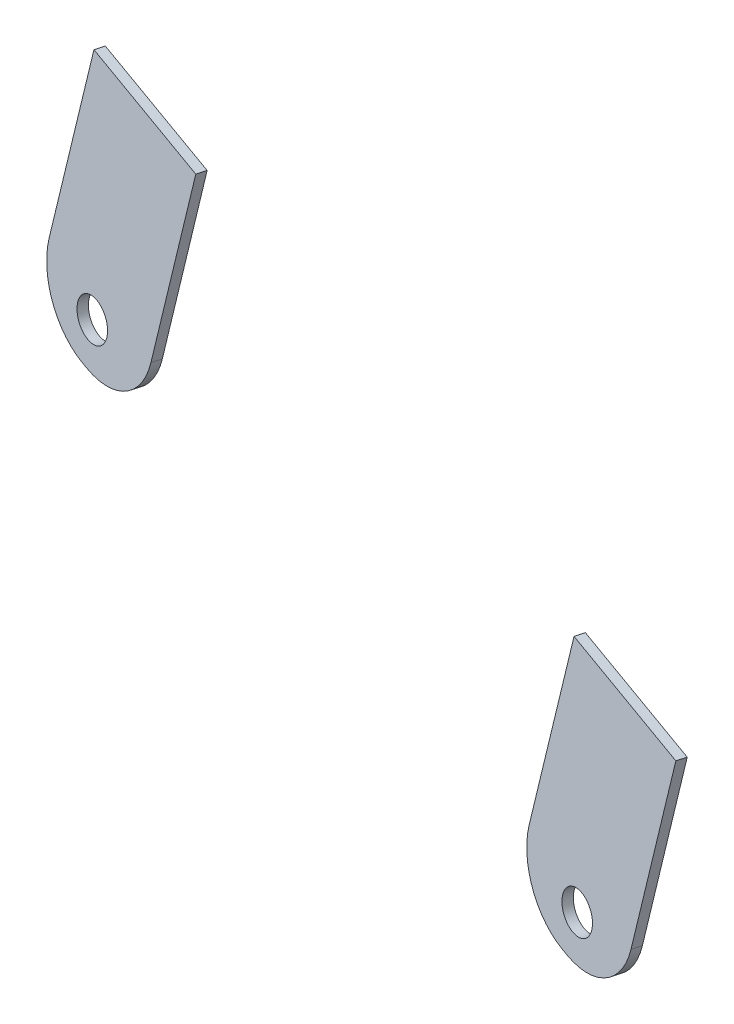
ISO-10303-21;
HEADER;
FILE_DESCRIPTION(('STEP AP214'),'2;1');
FILE_NAME('part.step','',(''),(''),'','','');
FILE_SCHEMA(('AUTOMOTIVE_DESIGN { 1 0 10303 214 1 1 1 1 }'));
ENDSEC;
DATA;
#1=APPLICATION_CONTEXT('core data for automotive mechanical design processes');
#2=APPLICATION_PROTOCOL_DEFINITION('international standard','automotive_design',2000,#1);
#3=PRODUCT_CONTEXT('',#1,'mechanical');
#4=PRODUCT('Part','Part','',(#3));
#5=PRODUCT_RELATED_PRODUCT_CATEGORY('part','',(#4));
#6=PRODUCT_DEFINITION_FORMATION('','',#4);
#7=PRODUCT_DEFINITION_CONTEXT('part definition',#1,'design');
#8=PRODUCT_DEFINITION('design','',#6,#7);
#9=PRODUCT_DEFINITION_SHAPE('','',#8);
#10=(LENGTH_UNIT() NAMED_UNIT(*) SI_UNIT(.MILLI.,.METRE.));
#11=(NAMED_UNIT(*) PLANE_ANGLE_UNIT() SI_UNIT($,.RADIAN.));
#12=(NAMED_UNIT(*) SI_UNIT($,.STERADIAN.) SOLID_ANGLE_UNIT());
#13=UNCERTAINTY_MEASURE_WITH_UNIT(LENGTH_MEASURE(1.E-05),#10,'distance_accuracy_value','');
#14=(GEOMETRIC_REPRESENTATION_CONTEXT(3) GLOBAL_UNCERTAINTY_ASSIGNED_CONTEXT((#13)) GLOBAL_UNIT_ASSIGNED_CONTEXT((#10,
#11,#12)) REPRESENTATION_CONTEXT('',''));
#15=CARTESIAN_POINT('',(0.,0.,0.));
#16=DIRECTION('',(0.,0.,1.));
#17=DIRECTION('',(1.,0.,0.));
#18=AXIS2_PLACEMENT_3D('',#15,#16,#17);
#19=CARTESIAN_POINT('',(21.345341230232,-6.68938215923422,-106.870411545878));
#20=DIRECTION('',(-0.195494617046695,0.0612657436296361,0.978789233371145));
#21=DIRECTION('',(0.98063135925573,0.,0.195862546813473));
#22=AXIS2_PLACEMENT_3D('',#19,#20,#21);
#23=PLANE('',#22);
#24=CARTESIAN_POINT('',(1126.13259403168,-258.790626718577,129.569797675979));
#25=DIRECTION('',(-0.195494617046686,0.061265743629639,0.978789233371147));
#26=DIRECTION('',(0.980631359255732,0.,0.195862546813464));
#27=AXIS2_PLACEMENT_3D('',#24,#25,#26);
#28=CIRCLE('',#27,2.99999999999978);
#29=CARTESIAN_POINT('',(1129.07448810945,-258.790626718577,130.157385316419));
#30=VERTEX_POINT('',#29);
#31=EDGE_CURVE('E133',#30,#30,#28,.T.);
#32=ORIENTED_EDGE('',*,*,#31,.F.);
#33=EDGE_LOOP('',(#32));
#34=FACE_BOUND('',#33,.T.);
#35=DIRECTION('',(0.222947026454173,0.974691253639158,-0.0164797898824405));
#36=VECTOR('',#35,1.);
#37=CARTESIAN_POINT('',(1140.01603064823,-241.996628761115,131.291557881148));
#38=LINE('',#37,#36);
#39=CARTESIAN_POINT('',(1136.44887822496,-257.591688819341,131.555234519267));
#40=VERTEX_POINT('',#39);
#41=CARTESIAN_POINT('',(1142.91434199214,-229.325642463806,131.077320612677));
#42=VERTEX_POINT('',#41);
#43=EDGE_CURVE('E108',#40,#42,#38,.T.);
#44=ORIENTED_EDGE('',*,*,#43,.T.);
#45=DIRECTION('',(0.955026951505036,-0.214996438893382,0.204205908734691));
#46=VECTOR('',#45,1.);
#47=CARTESIAN_POINT('',(1122.85877601053,-224.810717247044,126.788996529248));
#48=LINE('',#47,#46);
#49=CARTESIAN_POINT('',(1122.85877601053,-224.810717247044,126.788996529248));
#50=VERTEX_POINT('',#49);
#51=EDGE_CURVE('E190',#50,#42,#48,.T.);
#52=ORIENTED_EDGE('',*,*,#51,.F.);
#53=DIRECTION('',(-0.222947026454173,-0.974691253639158,0.016479789882437));
#54=VECTOR('',#53,1.);
#55=CARTESIAN_POINT('',(1119.96046466662,-237.481703544353,127.00323379772));
#56=LINE('',#55,#54);
#57=CARTESIAN_POINT('',(1116.39331224336,-253.07676360258,127.266910435839));
#58=VERTEX_POINT('',#57);
#59=EDGE_CURVE('E58',#50,#58,#56,.T.);
#60=ORIENTED_EDGE('',*,*,#59,.T.);
#61=CARTESIAN_POINT('',(1125.94358175841,-255.226727991514,129.308969523186));
#62=DIRECTION('',(-0.195494617046709,0.0612657436296458,0.978789233371142));
#63=DIRECTION('',(0.980631359255727,0.,0.195862546813487));
#64=AXIS2_PLACEMENT_3D('',#61,#62,#63);
#65=CIRCLE('',#64,10.);
#66=CARTESIAN_POINT('',(1123.71411149387,-264.973640527905,129.47376742201));
#67=VERTEX_POINT('',#66);
#68=EDGE_CURVE('E152',#58,#67,#65,.T.);
#69=ORIENTED_EDGE('',*,*,#68,.T.);
#70=DIRECTION('',(0.955026951505051,-0.214996438893341,0.204205908734669));
#71=VECTOR('',#70,1.);
#72=CARTESIAN_POINT('',(1123.71411149387,-264.973640527905,129.47376742201));
#73=LINE('',#72,#71);
#74=CARTESIAN_POINT('',(1124.66913844537,-265.188636966799,129.677973330745));
#75=VERTEX_POINT('',#74);
#76=EDGE_CURVE('E116',#67,#75,#73,.T.);
#77=ORIENTED_EDGE('',*,*,#76,.T.);
#78=CARTESIAN_POINT('',(1126.89860870991,-255.441724430407,129.51317543192));
#79=DIRECTION('',(-0.195494617046711,0.061265743629641,0.978789233371141));
#80=DIRECTION('',(0.980631359255727,0.,0.195862546813489));
#81=AXIS2_PLACEMENT_3D('',#78,#79,#80);
#82=CIRCLE('',#81,9.9999999999999);
#83=EDGE_CURVE('E101',#75,#40,#82,.T.);
#84=ORIENTED_EDGE('',*,*,#83,.T.);
#85=EDGE_LOOP('',(#44,#52,#60,#69,#77,#84));
#86=FACE_BOUND('',#85,.T.);
#87=ADVANCED_FACE('F49',(#34,#86),#23,.T.);
#88=CARTESIAN_POINT('',(21.6385831558019,-6.78128077467864,-108.338595395934));
#89=DIRECTION('',(-0.195494617046695,0.0612657436296361,0.978789233371145));
#90=DIRECTION('',(0.98063135925573,0.,0.195862546813473));
#91=AXIS2_PLACEMENT_3D('',#88,#89,#90);
#92=PLANE('',#91);
#93=CARTESIAN_POINT('',(1126.42583595725,-258.882525334021,128.101613825922));
#94=DIRECTION('',(-0.195494617046686,0.061265743629639,0.978789233371147));
#95=DIRECTION('',(0.980631359255732,0.,0.195862546813464));
#96=AXIS2_PLACEMENT_3D('',#93,#94,#95);
#97=CIRCLE('',#96,2.99999999999978);
#98=CARTESIAN_POINT('',(1129.36773003502,-258.882525334021,128.689201466363));
#99=VERTEX_POINT('',#98);
#100=EDGE_CURVE('E139',#99,#99,#97,.T.);
#101=ORIENTED_EDGE('',*,*,#100,.T.);
#102=EDGE_LOOP('',(#101));
#103=FACE_BOUND('',#102,.T.);
#104=DIRECTION('',(-0.222947026454173,-0.974691253639158,0.016479789882437));
#105=VECTOR('',#104,1.);
#106=CARTESIAN_POINT('',(1120.25370659219,-237.573602159798,125.535049947663));
#107=LINE('',#106,#105);
#108=CARTESIAN_POINT('',(1123.1520179361,-224.902615862489,125.320812679191));
#109=VERTEX_POINT('',#108);
#110=CARTESIAN_POINT('',(1116.68655416893,-253.168662218024,125.798726585782));
#111=VERTEX_POINT('',#110);
#112=EDGE_CURVE('E13',#109,#111,#107,.T.);
#113=ORIENTED_EDGE('',*,*,#112,.F.);
#114=DIRECTION('',(-0.955026951505036,0.214996438893381,-0.204205908734695));
#115=VECTOR('',#114,1.);
#116=CARTESIAN_POINT('',(1143.20758391771,-229.41754107925,129.60913676262));
#117=LINE('',#116,#115);
#118=CARTESIAN_POINT('',(1143.20758391771,-229.41754107925,129.60913676262));
#119=VERTEX_POINT('',#118);
#120=EDGE_CURVE('E97',#119,#109,#117,.T.);
#121=ORIENTED_EDGE('',*,*,#120,.F.);
#122=DIRECTION('',(0.222947026454173,0.974691253639158,-0.0164797898824405));
#123=VECTOR('',#122,1.);
#124=CARTESIAN_POINT('',(1140.3092725738,-242.088527376559,129.823374031092));
#125=LINE('',#124,#123);
#126=CARTESIAN_POINT('',(1136.74212015053,-257.683587434785,130.087050669211));
#127=VERTEX_POINT('',#126);
#128=EDGE_CURVE('E89',#127,#119,#125,.T.);
#129=ORIENTED_EDGE('',*,*,#128,.F.);
#130=CARTESIAN_POINT('',(1127.19185063548,-255.533623045852,128.044991581864));
#131=DIRECTION('',(-0.195494617046711,0.061265743629641,0.978789233371141));
#132=DIRECTION('',(0.980631359255727,0.,0.195862546813489));
#133=AXIS2_PLACEMENT_3D('',#130,#131,#132);
#134=CIRCLE('',#133,9.9999999999999);
#135=CARTESIAN_POINT('',(1124.96238037094,-265.280535582243,128.209789480688));
#136=VERTEX_POINT('',#135);
#137=EDGE_CURVE('E93',#136,#127,#134,.T.);
#138=ORIENTED_EDGE('',*,*,#137,.F.);
#139=DIRECTION('',(0.955026951505051,-0.214996438893341,0.204205908734669));
#140=VECTOR('',#139,1.);
#141=CARTESIAN_POINT('',(1124.00735341944,-265.06553914335,128.005583571953));
#142=LINE('',#141,#140);
#143=CARTESIAN_POINT('',(1124.00735341944,-265.06553914335,128.005583571953));
#144=VERTEX_POINT('',#143);
#145=EDGE_CURVE('E162',#144,#136,#142,.T.);
#146=ORIENTED_EDGE('',*,*,#145,.F.);
#147=CARTESIAN_POINT('',(1126.23682368398,-255.318626606958,127.840785673129));
#148=DIRECTION('',(-0.195494617046709,0.0612657436296458,0.978789233371142));
#149=DIRECTION('',(0.980631359255727,0.,0.195862546813487));
#150=AXIS2_PLACEMENT_3D('',#147,#148,#149);
#151=CIRCLE('',#150,10.);
#152=EDGE_CURVE('E67',#111,#144,#151,.T.);
#153=ORIENTED_EDGE('',*,*,#152,.F.);
#154=EDGE_LOOP('',(#113,#121,#129,#138,#146,#153));
#155=FACE_BOUND('',#154,.T.);
#156=ADVANCED_FACE('F91',(#103,#155),#92,.F.);
#157=CARTESIAN_POINT('',(1140.3092725738,-242.088527376559,129.823374031092));
#158=DIRECTION('',(0.955026951505059,-0.214996438893385,0.204205908734582));
#159=DIRECTION('',(0.219624372916741,0.975584509317839,0.));
#160=AXIS2_PLACEMENT_3D('',#157,#158,#159);
#161=PLANE('',#160);
#162=ORIENTED_EDGE('',*,*,#43,.F.);
#163=DIRECTION('',(-0.195494617046597,0.061265743629616,0.978789233371166));
#164=VECTOR('',#163,1.);
#165=CARTESIAN_POINT('',(1136.74212015053,-257.683587434785,130.087050669211));
#166=LINE('',#165,#164);
#167=EDGE_CURVE('E102',#127,#40,#166,.T.);
#168=ORIENTED_EDGE('',*,*,#167,.F.);
#169=ORIENTED_EDGE('',*,*,#128,.T.);
#170=DIRECTION('',(0.195494617046597,-0.0612657436296344,-0.978789233371165));
#171=VECTOR('',#170,1.);
#172=CARTESIAN_POINT('',(1142.91434199214,-229.325642463806,131.077320612677));
#173=LINE('',#172,#171);
#174=EDGE_CURVE('E189',#42,#119,#173,.T.);
#175=ORIENTED_EDGE('',*,*,#174,.F.);
#176=EDGE_LOOP('',(#162,#168,#169,#175));
#177=FACE_BOUND('',#176,.T.);
#178=ADVANCED_FACE('F106',(#177),#161,.T.);
#179=CARTESIAN_POINT('',(1127.19185063548,-255.533623045852,128.044991581864));
#180=DIRECTION('',(-0.195494617046597,0.061265743629616,0.978789233371166));
#181=DIRECTION('',(0.980631359255749,0.,0.195862546813375));
#182=AXIS2_PLACEMENT_3D('',#179,#180,#181);
#183=CYLINDRICAL_SURFACE('',#182,9.9999999999999);
#184=ORIENTED_EDGE('',*,*,#83,.F.);
#185=DIRECTION('',(-0.195494617046597,0.061265743629616,0.978789233371166));
#186=VECTOR('',#185,1.);
#187=CARTESIAN_POINT('',(1124.96238037094,-265.280535582243,128.209789480688));
#188=LINE('',#187,#186);
#189=EDGE_CURVE('E114',#136,#75,#188,.T.);
#190=ORIENTED_EDGE('',*,*,#189,.F.);
#191=ORIENTED_EDGE('',*,*,#137,.T.);
#192=ORIENTED_EDGE('',*,*,#167,.T.);
#193=EDGE_LOOP('',(#184,#190,#191,#192));
#194=FACE_BOUND('',#193,.T.);
#195=ADVANCED_FACE('F112',(#194),#183,.T.);
#196=CARTESIAN_POINT('',(1124.00735341944,-265.06553914335,128.005583571953));
#197=DIRECTION('',(-0.222947026454135,-0.974691253639166,0.0164797898824463));
#198=DIRECTION('',(0.974823635622994,-0.222977306986088,0.));
#199=AXIS2_PLACEMENT_3D('',#196,#197,#198);
#200=PLANE('',#199);
#201=ORIENTED_EDGE('',*,*,#76,.F.);
#202=DIRECTION('',(-0.195494617046597,0.061265743629616,0.978789233371166));
#203=VECTOR('',#202,1.);
#204=CARTESIAN_POINT('',(1124.00735341944,-265.06553914335,128.005583571953));
#205=LINE('',#204,#203);
#206=EDGE_CURVE('E118',#144,#67,#205,.T.);
#207=ORIENTED_EDGE('',*,*,#206,.F.);
#208=ORIENTED_EDGE('',*,*,#145,.T.);
#209=ORIENTED_EDGE('',*,*,#189,.T.);
#210=EDGE_LOOP('',(#201,#207,#208,#209));
#211=FACE_BOUND('',#210,.T.);
#212=ADVANCED_FACE('F176',(#211),#200,.T.);
#213=CARTESIAN_POINT('',(1126.23682368398,-255.318626606958,127.840785673129));
#214=DIRECTION('',(-0.195494617046597,0.061265743629616,0.978789233371166));
#215=DIRECTION('',(0.980631359255749,0.,0.195862546813375));
#216=AXIS2_PLACEMENT_3D('',#213,#214,#215);
#217=CYLINDRICAL_SURFACE('',#216,10.);
#218=ORIENTED_EDGE('',*,*,#68,.F.);
#219=DIRECTION('',(-0.195494617046597,0.061265743629616,0.978789233371166));
#220=VECTOR('',#219,1.);
#221=CARTESIAN_POINT('',(1116.68655416893,-253.168662218024,125.798726585782));
#222=LINE('',#221,#220);
#223=EDGE_CURVE('E149',#111,#58,#222,.T.);
#224=ORIENTED_EDGE('',*,*,#223,.F.);
#225=ORIENTED_EDGE('',*,*,#152,.T.);
#226=ORIENTED_EDGE('',*,*,#206,.T.);
#227=EDGE_LOOP('',(#218,#224,#225,#226));
#228=FACE_BOUND('',#227,.T.);
#229=ADVANCED_FACE('F179',(#228),#217,.T.);
#230=CARTESIAN_POINT('',(1120.25370659219,-237.573602159798,125.535049947663));
#231=DIRECTION('',(-0.955026951505059,0.214996438893386,-0.204205908734582));
#232=DIRECTION('',(-0.219624372916742,-0.975584509317838,0.));
#233=AXIS2_PLACEMENT_3D('',#230,#231,#232);
#234=PLANE('',#233);
#235=ORIENTED_EDGE('',*,*,#59,.F.);
#236=DIRECTION('',(-0.195494617046736,0.0612657436296684,0.978789233371135));
#237=VECTOR('',#236,1.);
#238=CARTESIAN_POINT('',(1123.1520179361,-224.902615862489,125.320812679191));
#239=LINE('',#238,#237);
#240=EDGE_CURVE('E185',#109,#50,#239,.T.);
#241=ORIENTED_EDGE('',*,*,#240,.F.);
#242=ORIENTED_EDGE('',*,*,#112,.T.);
#243=ORIENTED_EDGE('',*,*,#223,.T.);
#244=EDGE_LOOP('',(#235,#241,#242,#243));
#245=FACE_BOUND('',#244,.T.);
#246=ADVANCED_FACE('F183',(#245),#234,.T.);
#247=CARTESIAN_POINT('',(1126.42583595725,-258.882525334021,128.101613825922));
#248=DIRECTION('',(-0.195494617046597,0.061265743629616,0.978789233371166));
#249=DIRECTION('',(0.980631359255749,0.,0.195862546813375));
#250=AXIS2_PLACEMENT_3D('',#247,#248,#249);
#251=CYLINDRICAL_SURFACE('',#250,2.99999999999978);
#252=ORIENTED_EDGE('',*,*,#100,.F.);
#253=EDGE_LOOP('',(#252));
#254=FACE_BOUND('',#253,.T.);
#255=ORIENTED_EDGE('',*,*,#31,.T.);
#256=EDGE_LOOP('',(#255));
#257=FACE_BOUND('',#256,.T.);
#258=ADVANCED_FACE('F198',(#254,#257),#251,.F.);
#259=CARTESIAN_POINT('',(6.49389606596524,28.3903481387716,-0.480015564179602));
#260=DIRECTION('',(0.22294702645418,0.974691253639156,-0.0164797898824577));
#261=DIRECTION('',(-0.974823635622984,0.222977306986134,0.));
#262=AXIS2_PLACEMENT_3D('',#259,#260,#261);
#263=PLANE('',#262);
#264=ORIENTED_EDGE('',*,*,#240,.T.);
#265=ORIENTED_EDGE('',*,*,#51,.T.);
#266=ORIENTED_EDGE('',*,*,#174,.T.);
#267=ORIENTED_EDGE('',*,*,#120,.T.);
#268=EDGE_LOOP('',(#264,#265,#266,#267));
#269=FACE_BOUND('',#268,.T.);
#270=ADVANCED_FACE('F187',(#269),#263,.T.);
#271=CLOSED_SHELL('',(#87,#156,#178,#195,#212,#229,#246,#258,#270));
#272=MANIFOLD_SOLID_BREP('B2',#271);
#273=CARTESIAN_POINT('',(21.3453412302332,-6.68938215923501,-106.870411545882));
#274=DIRECTION('',(-0.195494617046698,0.0612657436296406,0.978789233371144));
#275=DIRECTION('',(0.980631359255729,0.,0.195862546813475));
#276=AXIS2_PLACEMENT_3D('',#273,#274,#275);
#277=PLANE('',#276);
#278=CARTESIAN_POINT('',(1030.62989888117,-237.290982829239,109.14920680251));
#279=DIRECTION('',(-0.195494617046672,0.0612657436296438,0.978789233371149));
#280=DIRECTION('',(0.980631359255735,0.,0.195862546813449));
#281=AXIS2_PLACEMENT_3D('',#278,#279,#280);
#282=CIRCLE('',#281,3.00000000000002);
#283=CARTESIAN_POINT('',(1033.57179295894,-237.290982829239,109.73679444295));
#284=VERTEX_POINT('',#283);
#285=EDGE_CURVE('E370',#284,#284,#282,.T.);
#286=ORIENTED_EDGE('',*,*,#285,.F.);
#287=EDGE_LOOP('',(#286));
#288=FACE_BOUND('',#287,.T.);
#289=DIRECTION('',(0.222947026454173,0.974691253639158,-0.016479789882444));
#290=VECTOR('',#289,1.);
#291=CARTESIAN_POINT('',(1045.46836244923,-220.71198131067,111.075172916413));
#292=LINE('',#291,#290);
#293=CARTESIAN_POINT('',(1041.90121002596,-236.307041368896,111.338849554532));
#294=VERTEX_POINT('',#293);
#295=CARTESIAN_POINT('',(1048.36667379314,-208.040995013361,110.860935647942));
#296=VERTEX_POINT('',#295);
#297=EDGE_CURVE('E345',#294,#296,#292,.T.);
#298=ORIENTED_EDGE('',*,*,#297,.T.);
#299=DIRECTION('',(0.955026951505036,-0.214996438893383,0.204205908734691));
#300=VECTOR('',#299,1.);
#301=CARTESIAN_POINT('',(1028.31110781153,-203.5260697966,106.572611564513));
#302=LINE('',#301,#300);
#303=CARTESIAN_POINT('',(1028.31110781153,-203.5260697966,106.572611564513));
#304=VERTEX_POINT('',#303);
#305=EDGE_CURVE('E427',#304,#296,#302,.T.);
#306=ORIENTED_EDGE('',*,*,#305,.F.);
#307=DIRECTION('',(-0.222947026454173,-0.974691253639158,0.016479789882437));
#308=VECTOR('',#307,1.);
#309=CARTESIAN_POINT('',(1025.41279646763,-216.197056093909,106.786848832985));
#310=LINE('',#309,#308);
#311=CARTESIAN_POINT('',(1021.84564404436,-231.792116152135,107.050525471104));
#312=VERTEX_POINT('',#311);
#313=EDGE_CURVE('E295',#304,#312,#310,.T.);
#314=ORIENTED_EDGE('',*,*,#313,.T.);
#315=CARTESIAN_POINT('',(1031.39591355941,-233.942080541069,109.092584558451));
#316=DIRECTION('',(-0.195494617046711,0.0612657436296436,0.978789233371141));
#317=DIRECTION('',(0.980631359255727,0.,0.195862546813489));
#318=AXIS2_PLACEMENT_3D('',#315,#316,#317);
#319=CIRCLE('',#318,9.99999999999994);
#320=CARTESIAN_POINT('',(1029.16644329487,-243.68899307746,109.257382457275));
#321=VERTEX_POINT('',#320);
#322=EDGE_CURVE('E389',#312,#321,#319,.T.);
#323=ORIENTED_EDGE('',*,*,#322,.T.);
#324=DIRECTION('',(0.955026951505053,-0.214996438893336,0.204205908734661));
#325=VECTOR('',#324,1.);
#326=CARTESIAN_POINT('',(1029.16644329487,-243.68899307746,109.257382457275));
#327=LINE('',#326,#325);
#328=CARTESIAN_POINT('',(1030.12147024637,-243.903989516354,109.46158836601));
#329=VERTEX_POINT('',#328);
#330=EDGE_CURVE('E353',#321,#329,#327,.T.);
#331=ORIENTED_EDGE('',*,*,#330,.T.);
#332=CARTESIAN_POINT('',(1032.35094051091,-234.157076979962,109.296790467186));
#333=DIRECTION('',(-0.19549461704671,0.0612657436296432,0.978789233371142));
#334=DIRECTION('',(0.980631359255727,0.,0.195862546813487));
#335=AXIS2_PLACEMENT_3D('',#332,#333,#334);
#336=CIRCLE('',#335,10.);
#337=EDGE_CURVE('E338',#329,#294,#336,.T.);
#338=ORIENTED_EDGE('',*,*,#337,.T.);
#339=EDGE_LOOP('',(#298,#306,#314,#323,#331,#338));
#340=FACE_BOUND('',#339,.T.);
#341=ADVANCED_FACE('F286',(#288,#340),#277,.T.);
#342=CARTESIAN_POINT('',(21.6385831558031,-6.78128077467943,-108.338595395939));
#343=DIRECTION('',(-0.195494617046698,0.0612657436296406,0.978789233371144));
#344=DIRECTION('',(0.980631359255729,0.,0.195862546813475));
#345=AXIS2_PLACEMENT_3D('',#342,#343,#344);
#346=PLANE('',#345);
#347=CARTESIAN_POINT('',(1030.92314080674,-237.382881444683,107.681022952453));
#348=DIRECTION('',(-0.195494617046672,0.0612657436296438,0.978789233371149));
#349=DIRECTION('',(0.980631359255735,0.,0.195862546813449));
#350=AXIS2_PLACEMENT_3D('',#347,#348,#349);
#351=CIRCLE('',#350,3.00000000000002);
#352=CARTESIAN_POINT('',(1033.86503488451,-237.382881444683,108.268610592893));
#353=VERTEX_POINT('',#352);
#354=EDGE_CURVE('E376',#353,#353,#351,.T.);
#355=ORIENTED_EDGE('',*,*,#354,.T.);
#356=EDGE_LOOP('',(#355));
#357=FACE_BOUND('',#356,.T.);
#358=DIRECTION('',(-0.222947026454173,-0.974691253639158,0.016479789882437));
#359=VECTOR('',#358,1.);
#360=CARTESIAN_POINT('',(1025.7060383932,-216.288954709353,105.318664982928));
#361=LINE('',#360,#359);
#362=CARTESIAN_POINT('',(1028.6043497371,-203.617968412044,105.104427714456));
#363=VERTEX_POINT('',#362);
#364=CARTESIAN_POINT('',(1022.13888596993,-231.884014767579,105.582341621047));
#365=VERTEX_POINT('',#364);
#366=EDGE_CURVE('E47',#363,#365,#361,.T.);
#367=ORIENTED_EDGE('',*,*,#366,.F.);
#368=DIRECTION('',(-0.955026951505037,0.214996438893381,-0.204205908734691));
#369=VECTOR('',#368,1.);
#370=CARTESIAN_POINT('',(1048.65991571871,-208.132893628805,109.392751797885));
#371=LINE('',#370,#369);
#372=CARTESIAN_POINT('',(1048.65991571871,-208.132893628805,109.392751797885));
#373=VERTEX_POINT('',#372);
#374=EDGE_CURVE('E334',#373,#363,#371,.T.);
#375=ORIENTED_EDGE('',*,*,#374,.F.);
#376=DIRECTION('',(0.222947026454173,0.974691253639158,-0.016479789882444));
#377=VECTOR('',#376,1.);
#378=CARTESIAN_POINT('',(1045.7616043748,-220.803879926114,109.606989066357));
#379=LINE('',#378,#377);
#380=CARTESIAN_POINT('',(1042.19445195153,-236.398939984341,109.870665704476));
#381=VERTEX_POINT('',#380);
#382=EDGE_CURVE('E326',#381,#373,#379,.T.);
#383=ORIENTED_EDGE('',*,*,#382,.F.);
#384=CARTESIAN_POINT('',(1032.64418243648,-234.248975595407,107.828606617129));
#385=DIRECTION('',(-0.19549461704671,0.0612657436296432,0.978789233371142));
#386=DIRECTION('',(0.980631359255727,0.,0.195862546813487));
#387=AXIS2_PLACEMENT_3D('',#384,#385,#386);
#388=CIRCLE('',#387,10.);
#389=CARTESIAN_POINT('',(1030.41471217194,-243.995888131798,107.993404515953));
#390=VERTEX_POINT('',#389);
#391=EDGE_CURVE('E330',#390,#381,#388,.T.);
#392=ORIENTED_EDGE('',*,*,#391,.F.);
#393=DIRECTION('',(0.955026951505053,-0.214996438893336,0.204205908734661));
#394=VECTOR('',#393,1.);
#395=CARTESIAN_POINT('',(1029.45968522044,-243.780891692905,107.789198607218));
#396=LINE('',#395,#394);
#397=CARTESIAN_POINT('',(1029.45968522044,-243.780891692905,107.789198607218));
#398=VERTEX_POINT('',#397);
#399=EDGE_CURVE('E399',#398,#390,#396,.T.);
#400=ORIENTED_EDGE('',*,*,#399,.F.);
#401=CARTESIAN_POINT('',(1031.68915548498,-234.033979156513,107.624400708394));
#402=DIRECTION('',(-0.195494617046711,0.0612657436296436,0.978789233371141));
#403=DIRECTION('',(0.980631359255727,0.,0.195862546813489));
#404=AXIS2_PLACEMENT_3D('',#401,#402,#403);
#405=CIRCLE('',#404,9.99999999999994);
#406=EDGE_CURVE('E304',#365,#398,#405,.T.);
#407=ORIENTED_EDGE('',*,*,#406,.F.);
#408=EDGE_LOOP('',(#367,#375,#383,#392,#400,#407));
#409=FACE_BOUND('',#408,.T.);
#410=ADVANCED_FACE('F328',(#357,#409),#346,.F.);
#411=CARTESIAN_POINT('',(1045.7616043748,-220.803879926114,109.606989066357));
#412=DIRECTION('',(0.955026951505059,-0.214996438893384,0.204205908734582));
#413=DIRECTION('',(0.219624372916741,0.975584509317839,0.));
#414=AXIS2_PLACEMENT_3D('',#411,#412,#413);
#415=PLANE('',#414);
#416=ORIENTED_EDGE('',*,*,#297,.F.);
#417=DIRECTION('',(-0.195494617046597,0.061265743629616,0.978789233371166));
#418=VECTOR('',#417,1.);
#419=CARTESIAN_POINT('',(1042.19445195153,-236.398939984341,109.870665704476));
#420=LINE('',#419,#418);
#421=EDGE_CURVE('E339',#381,#294,#420,.T.);
#422=ORIENTED_EDGE('',*,*,#421,.F.);
#423=ORIENTED_EDGE('',*,*,#382,.T.);
#424=DIRECTION('',(0.195494617046599,-0.0612657436295981,-0.978789233371167));
#425=VECTOR('',#424,1.);
#426=CARTESIAN_POINT('',(1048.36667379314,-208.040995013361,110.860935647942));
#427=LINE('',#426,#425);
#428=EDGE_CURVE('E426',#296,#373,#427,.T.);
#429=ORIENTED_EDGE('',*,*,#428,.F.);
#430=EDGE_LOOP('',(#416,#422,#423,#429));
#431=FACE_BOUND('',#430,.T.);
#432=ADVANCED_FACE('F343',(#431),#415,.T.);
#433=CARTESIAN_POINT('',(1032.64418243648,-234.248975595407,107.828606617129));
#434=DIRECTION('',(-0.195494617046597,0.061265743629616,0.978789233371166));
#435=DIRECTION('',(0.980631359255749,0.,0.195862546813375));
#436=AXIS2_PLACEMENT_3D('',#433,#434,#435);
#437=CYLINDRICAL_SURFACE('',#436,10.);
#438=ORIENTED_EDGE('',*,*,#337,.F.);
#439=DIRECTION('',(-0.195494617046597,0.061265743629616,0.978789233371166));
#440=VECTOR('',#439,1.);
#441=CARTESIAN_POINT('',(1030.41471217194,-243.995888131798,107.993404515953));
#442=LINE('',#441,#440);
#443=EDGE_CURVE('E351',#390,#329,#442,.T.);
#444=ORIENTED_EDGE('',*,*,#443,.F.);
#445=ORIENTED_EDGE('',*,*,#391,.T.);
#446=ORIENTED_EDGE('',*,*,#421,.T.);
#447=EDGE_LOOP('',(#438,#444,#445,#446));
#448=FACE_BOUND('',#447,.T.);
#449=ADVANCED_FACE('F349',(#448),#437,.T.);
#450=CARTESIAN_POINT('',(1029.45968522044,-243.780891692905,107.789198607218));
#451=DIRECTION('',(-0.222947026454129,-0.974691253639168,0.0164797898824474));
#452=DIRECTION('',(0.974823635622995,-0.222977306986083,0.));
#453=AXIS2_PLACEMENT_3D('',#450,#451,#452);
#454=PLANE('',#453);
#455=ORIENTED_EDGE('',*,*,#330,.F.);
#456=DIRECTION('',(-0.195494617046597,0.061265743629616,0.978789233371166));
#457=VECTOR('',#456,1.);
#458=CARTESIAN_POINT('',(1029.45968522044,-243.780891692905,107.789198607218));
#459=LINE('',#458,#457);
#460=EDGE_CURVE('E355',#398,#321,#459,.T.);
#461=ORIENTED_EDGE('',*,*,#460,.F.);
#462=ORIENTED_EDGE('',*,*,#399,.T.);
#463=ORIENTED_EDGE('',*,*,#443,.T.);
#464=EDGE_LOOP('',(#455,#461,#462,#463));
#465=FACE_BOUND('',#464,.T.);
#466=ADVANCED_FACE('F413',(#465),#454,.T.);
#467=CARTESIAN_POINT('',(1031.68915548498,-234.033979156513,107.624400708394));
#468=DIRECTION('',(-0.195494617046597,0.061265743629616,0.978789233371166));
#469=DIRECTION('',(0.980631359255749,0.,0.195862546813375));
#470=AXIS2_PLACEMENT_3D('',#467,#468,#469);
#471=CYLINDRICAL_SURFACE('',#470,9.99999999999994);
#472=ORIENTED_EDGE('',*,*,#322,.F.);
#473=DIRECTION('',(-0.195494617046597,0.061265743629616,0.978789233371166));
#474=VECTOR('',#473,1.);
#475=CARTESIAN_POINT('',(1022.13888596993,-231.884014767579,105.582341621047));
#476=LINE('',#475,#474);
#477=EDGE_CURVE('E386',#365,#312,#476,.T.);
#478=ORIENTED_EDGE('',*,*,#477,.F.);
#479=ORIENTED_EDGE('',*,*,#406,.T.);
#480=ORIENTED_EDGE('',*,*,#460,.T.);
#481=EDGE_LOOP('',(#472,#478,#479,#480));
#482=FACE_BOUND('',#481,.T.);
#483=ADVANCED_FACE('F416',(#482),#471,.T.);
#484=CARTESIAN_POINT('',(1025.7060383932,-216.288954709353,105.318664982928));
#485=DIRECTION('',(-0.955026951505059,0.214996438893386,-0.204205908734582));
#486=DIRECTION('',(-0.219624372916742,-0.975584509317838,0.));
#487=AXIS2_PLACEMENT_3D('',#484,#485,#486);
#488=PLANE('',#487);
#489=ORIENTED_EDGE('',*,*,#313,.F.);
#490=DIRECTION('',(-0.195494617046601,0.0612657436296171,0.978789233371165));
#491=VECTOR('',#490,1.);
#492=CARTESIAN_POINT('',(1028.6043497371,-203.617968412044,105.104427714456));
#493=LINE('',#492,#491);
#494=EDGE_CURVE('E422',#363,#304,#493,.T.);
#495=ORIENTED_EDGE('',*,*,#494,.F.);
#496=ORIENTED_EDGE('',*,*,#366,.T.);
#497=ORIENTED_EDGE('',*,*,#477,.T.);
#498=EDGE_LOOP('',(#489,#495,#496,#497));
#499=FACE_BOUND('',#498,.T.);
#500=ADVANCED_FACE('F420',(#499),#488,.T.);
#501=CARTESIAN_POINT('',(1030.92314080674,-237.382881444683,107.681022952453));
#502=DIRECTION('',(-0.195494617046597,0.061265743629616,0.978789233371166));
#503=DIRECTION('',(0.980631359255749,0.,0.195862546813375));
#504=AXIS2_PLACEMENT_3D('',#501,#502,#503);
#505=CYLINDRICAL_SURFACE('',#504,3.00000000000002);
#506=ORIENTED_EDGE('',*,*,#354,.F.);
#507=EDGE_LOOP('',(#506));
#508=FACE_BOUND('',#507,.T.);
#509=ORIENTED_EDGE('',*,*,#285,.T.);
#510=EDGE_LOOP('',(#509));
#511=FACE_BOUND('',#510,.T.);
#512=ADVANCED_FACE('F435',(#508,#511),#505,.F.);
#513=CARTESIAN_POINT('',(6.49389606596486,28.3903481387702,-0.480015564179252));
#514=DIRECTION('',(0.222947026454177,0.974691253639157,-0.0164797898824375));
#515=DIRECTION('',(-0.974823635622984,0.22297730698613,0.));
#516=AXIS2_PLACEMENT_3D('',#513,#514,#515);
#517=PLANE('',#516);
#518=ORIENTED_EDGE('',*,*,#494,.T.);
#519=ORIENTED_EDGE('',*,*,#305,.T.);
#520=ORIENTED_EDGE('',*,*,#428,.T.);
#521=ORIENTED_EDGE('',*,*,#374,.T.);
#522=EDGE_LOOP('',(#518,#519,#520,#521));
#523=FACE_BOUND('',#522,.T.);
#524=ADVANCED_FACE('F424',(#523),#517,.T.);
#525=CLOSED_SHELL('',(#341,#410,#432,#449,#466,#483,#500,#512,#524));
#526=MANIFOLD_SOLID_BREP('B7',#525);
#527=ADVANCED_BREP_SHAPE_REPRESENTATION('',(#18,#272,#526),#14);
#528=SHAPE_DEFINITION_REPRESENTATION(#9,#527);
ENDSEC;
END-ISO-10303-21;
